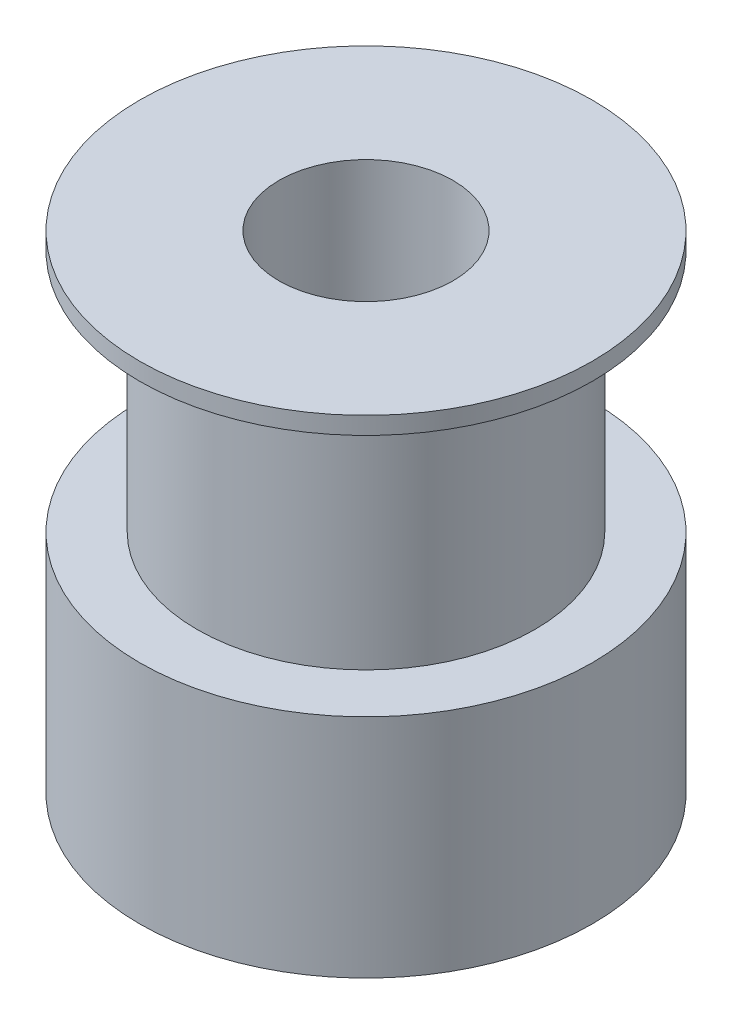
ISO-10303-21;
HEADER;
FILE_DESCRIPTION(('STEP AP214'),'2;1');
FILE_NAME('part.step','',(''),(''),'','','');
FILE_SCHEMA(('AUTOMOTIVE_DESIGN { 1 0 10303 214 1 1 1 1 }'));
ENDSEC;
DATA;
#1=APPLICATION_CONTEXT('core data for automotive mechanical design processes');
#2=APPLICATION_PROTOCOL_DEFINITION('international standard','automotive_design',2000,#1);
#3=PRODUCT_CONTEXT('',#1,'mechanical');
#4=PRODUCT('Part','Part','',(#3));
#5=PRODUCT_RELATED_PRODUCT_CATEGORY('part','',(#4));
#6=PRODUCT_DEFINITION_FORMATION('','',#4);
#7=PRODUCT_DEFINITION_CONTEXT('part definition',#1,'design');
#8=PRODUCT_DEFINITION('design','',#6,#7);
#9=PRODUCT_DEFINITION_SHAPE('','',#8);
#10=(LENGTH_UNIT() NAMED_UNIT(*) SI_UNIT(.MILLI.,.METRE.));
#11=(NAMED_UNIT(*) PLANE_ANGLE_UNIT() SI_UNIT($,.RADIAN.));
#12=(NAMED_UNIT(*) SI_UNIT($,.STERADIAN.) SOLID_ANGLE_UNIT());
#13=UNCERTAINTY_MEASURE_WITH_UNIT(LENGTH_MEASURE(1.E-05),#10,'distance_accuracy_value','');
#14=(GEOMETRIC_REPRESENTATION_CONTEXT(3) GLOBAL_UNCERTAINTY_ASSIGNED_CONTEXT((#13)) GLOBAL_UNIT_ASSIGNED_CONTEXT((#10,
#11,#12)) REPRESENTATION_CONTEXT('',''));
#15=CARTESIAN_POINT('',(0.,0.,0.));
#16=DIRECTION('',(0.,0.,1.));
#17=DIRECTION('',(1.,0.,0.));
#18=AXIS2_PLACEMENT_3D('',#15,#16,#17);
#19=CARTESIAN_POINT('',(0.,6.5,0.));
#20=DIRECTION('',(0.,-1.,0.));
#21=DIRECTION('',(0.,0.,-1.));
#22=AXIS2_PLACEMENT_3D('',#19,#20,#21);
#23=CYLINDRICAL_SURFACE('',#22,6.5);
#24=CARTESIAN_POINT('',(0.,6.5,0.));
#25=DIRECTION('',(0.,1.,0.));
#26=DIRECTION('',(0.,0.,1.));
#27=AXIS2_PLACEMENT_3D('',#24,#25,#26);
#28=CIRCLE('',#27,6.5);
#29=CARTESIAN_POINT('',(0.,6.5,6.5));
#30=VERTEX_POINT('',#29);
#31=EDGE_CURVE('E45',#30,#30,#28,.T.);
#32=ORIENTED_EDGE('',*,*,#31,.F.);
#33=EDGE_LOOP('',(#32));
#34=FACE_BOUND('',#33,.T.);
#35=CARTESIAN_POINT('',(0.,0.,0.));
#36=DIRECTION('',(0.,1.,0.));
#37=DIRECTION('',(0.,0.,1.));
#38=AXIS2_PLACEMENT_3D('',#35,#36,#37);
#39=CIRCLE('',#38,6.5);
#40=CARTESIAN_POINT('',(0.,0.,6.5));
#41=VERTEX_POINT('',#40);
#42=EDGE_CURVE('E40',#41,#41,#39,.T.);
#43=ORIENTED_EDGE('',*,*,#42,.T.);
#44=EDGE_LOOP('',(#43));
#45=FACE_BOUND('',#44,.T.);
#46=ADVANCED_FACE('F37',(#34,#45),#23,.T.);
#47=CARTESIAN_POINT('',(0.,6.5,0.));
#48=DIRECTION('',(0.,1.,0.));
#49=DIRECTION('',(0.,0.,1.));
#50=AXIS2_PLACEMENT_3D('',#47,#48,#49);
#51=PLANE('',#50);
#52=CARTESIAN_POINT('',(0.,6.5,0.));
#53=DIRECTION('',(0.,1.,0.));
#54=DIRECTION('',(0.,0.,1.));
#55=AXIS2_PLACEMENT_3D('',#52,#53,#54);
#56=CIRCLE('',#55,4.85);
#57=CARTESIAN_POINT('',(0.,6.5,4.85));
#58=VERTEX_POINT('',#57);
#59=EDGE_CURVE('E10',#58,#58,#56,.T.);
#60=ORIENTED_EDGE('',*,*,#59,.F.);
#61=EDGE_LOOP('',(#60));
#62=FACE_BOUND('',#61,.T.);
#63=ORIENTED_EDGE('',*,*,#31,.T.);
#64=EDGE_LOOP('',(#63));
#65=FACE_BOUND('',#64,.T.);
#66=ADVANCED_FACE('F102',(#62,#65),#51,.T.);
#67=CARTESIAN_POINT('',(0.,0.,0.));
#68=DIRECTION('',(0.,1.,0.));
#69=DIRECTION('',(0.,0.,1.));
#70=AXIS2_PLACEMENT_3D('',#67,#68,#69);
#71=PLANE('',#70);
#72=CARTESIAN_POINT('',(0.,0.,0.));
#73=DIRECTION('',(0.,1.,0.));
#74=DIRECTION('',(0.,0.,1.));
#75=AXIS2_PLACEMENT_3D('',#72,#73,#74);
#76=CIRCLE('',#75,2.5);
#77=CARTESIAN_POINT('',(0.,0.,2.5));
#78=VERTEX_POINT('',#77);
#79=EDGE_CURVE('E61',#78,#78,#76,.T.);
#80=ORIENTED_EDGE('',*,*,#79,.T.);
#81=EDGE_LOOP('',(#80));
#82=FACE_BOUND('',#81,.T.);
#83=ORIENTED_EDGE('',*,*,#42,.F.);
#84=EDGE_LOOP('',(#83));
#85=FACE_BOUND('',#84,.T.);
#86=ADVANCED_FACE('F73',(#82,#85),#71,.F.);
#87=CARTESIAN_POINT('',(0.,13.5,0.));
#88=DIRECTION('',(0.,-1.,0.));
#89=DIRECTION('',(0.,0.,-1.));
#90=AXIS2_PLACEMENT_3D('',#87,#88,#89);
#91=CYLINDRICAL_SURFACE('',#90,4.85);
#92=CARTESIAN_POINT('',(0.,13.5,0.));
#93=DIRECTION('',(0.,1.,0.));
#94=DIRECTION('',(0.,0.,1.));
#95=AXIS2_PLACEMENT_3D('',#92,#93,#94);
#96=CIRCLE('',#95,4.85);
#97=CARTESIAN_POINT('',(0.,13.5,4.85));
#98=VERTEX_POINT('',#97);
#99=EDGE_CURVE('E52',#98,#98,#96,.T.);
#100=ORIENTED_EDGE('',*,*,#99,.F.);
#101=EDGE_LOOP('',(#100));
#102=FACE_BOUND('',#101,.T.);
#103=ORIENTED_EDGE('',*,*,#59,.T.);
#104=EDGE_LOOP('',(#103));
#105=FACE_BOUND('',#104,.T.);
#106=ADVANCED_FACE('F92',(#102,#105),#91,.T.);
#107=CARTESIAN_POINT('',(0.,14.,0.));
#108=DIRECTION('',(0.,-1.,0.));
#109=DIRECTION('',(0.,0.,-1.));
#110=AXIS2_PLACEMENT_3D('',#107,#108,#109);
#111=CYLINDRICAL_SURFACE('',#110,6.5);
#112=CARTESIAN_POINT('',(0.,14.,0.));
#113=DIRECTION('',(0.,1.,0.));
#114=DIRECTION('',(0.,0.,1.));
#115=AXIS2_PLACEMENT_3D('',#112,#113,#114);
#116=CIRCLE('',#115,6.5);
#117=CARTESIAN_POINT('',(0.,14.,6.5));
#118=VERTEX_POINT('',#117);
#119=EDGE_CURVE('E56',#118,#118,#116,.T.);
#120=ORIENTED_EDGE('',*,*,#119,.F.);
#121=EDGE_LOOP('',(#120));
#122=FACE_BOUND('',#121,.T.);
#123=CARTESIAN_POINT('',(0.,13.5,0.));
#124=DIRECTION('',(0.,1.,0.));
#125=DIRECTION('',(0.,0.,1.));
#126=AXIS2_PLACEMENT_3D('',#123,#124,#125);
#127=CIRCLE('',#126,6.5);
#128=CARTESIAN_POINT('',(0.,13.5,6.5));
#129=VERTEX_POINT('',#128);
#130=EDGE_CURVE('E57',#129,#129,#127,.T.);
#131=ORIENTED_EDGE('',*,*,#130,.T.);
#132=EDGE_LOOP('',(#131));
#133=FACE_BOUND('',#132,.T.);
#134=ADVANCED_FACE('F86',(#122,#133),#111,.T.);
#135=CARTESIAN_POINT('',(0.,14.,0.));
#136=DIRECTION('',(0.,1.,0.));
#137=DIRECTION('',(0.,0.,1.));
#138=AXIS2_PLACEMENT_3D('',#135,#136,#137);
#139=PLANE('',#138);
#140=CARTESIAN_POINT('',(0.,14.,0.));
#141=DIRECTION('',(0.,1.,0.));
#142=DIRECTION('',(0.,0.,1.));
#143=AXIS2_PLACEMENT_3D('',#140,#141,#142);
#144=CIRCLE('',#143,2.5);
#145=CARTESIAN_POINT('',(0.,14.,2.5));
#146=VERTEX_POINT('',#145);
#147=EDGE_CURVE('E65',#146,#146,#144,.T.);
#148=ORIENTED_EDGE('',*,*,#147,.F.);
#149=EDGE_LOOP('',(#148));
#150=FACE_BOUND('',#149,.T.);
#151=ORIENTED_EDGE('',*,*,#119,.T.);
#152=EDGE_LOOP('',(#151));
#153=FACE_BOUND('',#152,.T.);
#154=ADVANCED_FACE('F83',(#150,#153),#139,.T.);
#155=CARTESIAN_POINT('',(0.,13.5,0.));
#156=DIRECTION('',(0.,1.,0.));
#157=DIRECTION('',(0.,0.,1.));
#158=AXIS2_PLACEMENT_3D('',#155,#156,#157);
#159=PLANE('',#158);
#160=ORIENTED_EDGE('',*,*,#99,.T.);
#161=EDGE_LOOP('',(#160));
#162=FACE_BOUND('',#161,.T.);
#163=ORIENTED_EDGE('',*,*,#130,.F.);
#164=EDGE_LOOP('',(#163));
#165=FACE_BOUND('',#164,.T.);
#166=ADVANCED_FACE('F79',(#162,#165),#159,.F.);
#167=CARTESIAN_POINT('',(0.,0.,0.));
#168=DIRECTION('',(0.,1.,0.));
#169=DIRECTION('',(0.,0.,1.));
#170=AXIS2_PLACEMENT_3D('',#167,#168,#169);
#171=CYLINDRICAL_SURFACE('',#170,2.5);
#172=ORIENTED_EDGE('',*,*,#79,.F.);
#173=EDGE_LOOP('',(#172));
#174=FACE_BOUND('',#173,.T.);
#175=ORIENTED_EDGE('',*,*,#147,.T.);
#176=EDGE_LOOP('',(#175));
#177=FACE_BOUND('',#176,.T.);
#178=ADVANCED_FACE('F76',(#174,#177),#171,.F.);
#179=CLOSED_SHELL('',(#46,#66,#86,#106,#134,#154,#166,#178));
#180=MANIFOLD_SOLID_BREP('B2',#179);
#181=ADVANCED_BREP_SHAPE_REPRESENTATION('',(#18,#180),#14);
#182=SHAPE_DEFINITION_REPRESENTATION(#9,#181);
ENDSEC;
END-ISO-10303-21;
